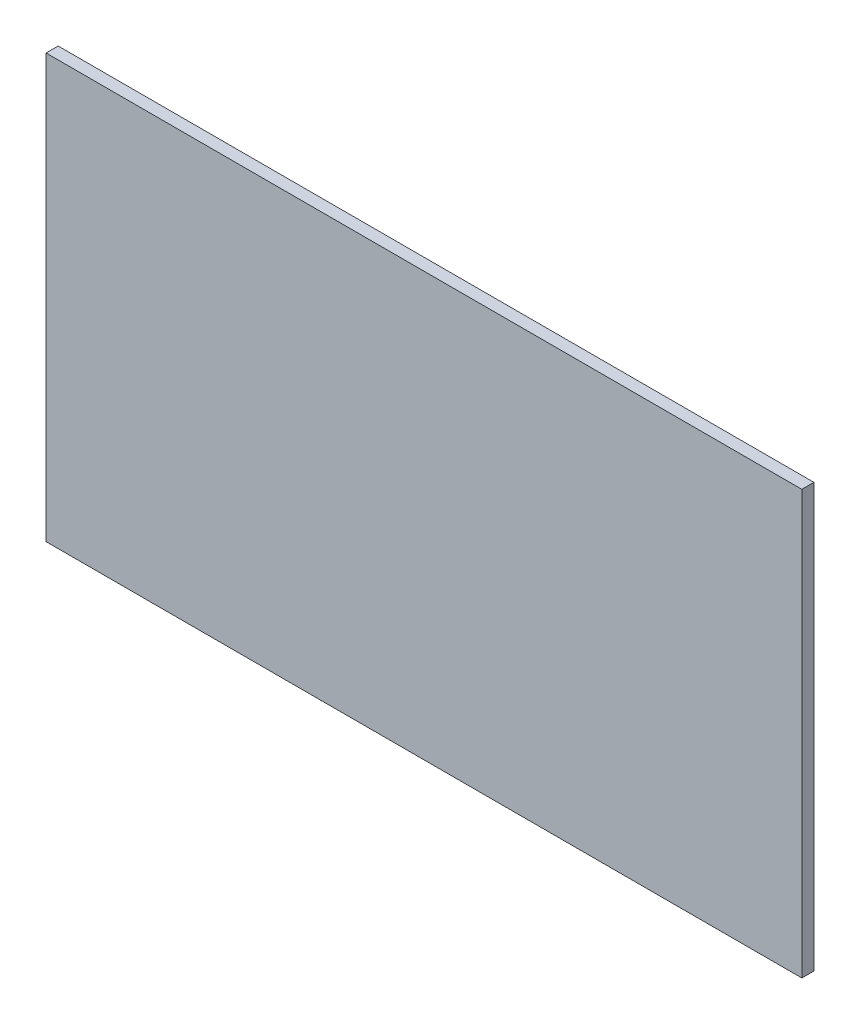
ISO-10303-21;
HEADER;
FILE_DESCRIPTION(('STEP AP214'),'2;1');
FILE_NAME('part.step','',(''),(''),'','','');
FILE_SCHEMA(('AUTOMOTIVE_DESIGN { 1 0 10303 214 1 1 1 1 }'));
ENDSEC;
DATA;
#1=APPLICATION_CONTEXT('core data for automotive mechanical design processes');
#2=APPLICATION_PROTOCOL_DEFINITION('international standard','automotive_design',2000,#1);
#3=PRODUCT_CONTEXT('',#1,'mechanical');
#4=PRODUCT('Part','Part','',(#3));
#5=PRODUCT_RELATED_PRODUCT_CATEGORY('part','',(#4));
#6=PRODUCT_DEFINITION_FORMATION('','',#4);
#7=PRODUCT_DEFINITION_CONTEXT('part definition',#1,'design');
#8=PRODUCT_DEFINITION('design','',#6,#7);
#9=PRODUCT_DEFINITION_SHAPE('','',#8);
#10=(LENGTH_UNIT() NAMED_UNIT(*) SI_UNIT(.MILLI.,.METRE.));
#11=(NAMED_UNIT(*) PLANE_ANGLE_UNIT() SI_UNIT($,.RADIAN.));
#12=(NAMED_UNIT(*) SI_UNIT($,.STERADIAN.) SOLID_ANGLE_UNIT());
#13=UNCERTAINTY_MEASURE_WITH_UNIT(LENGTH_MEASURE(1.E-05),#10,'distance_accuracy_value','');
#14=(GEOMETRIC_REPRESENTATION_CONTEXT(3) GLOBAL_UNCERTAINTY_ASSIGNED_CONTEXT((#13)) GLOBAL_UNIT_ASSIGNED_CONTEXT((#10,
#11,#12)) REPRESENTATION_CONTEXT('',''));
#15=CARTESIAN_POINT('',(0.,0.,0.));
#16=DIRECTION('',(0.,0.,1.));
#17=DIRECTION('',(1.,0.,0.));
#18=AXIS2_PLACEMENT_3D('',#15,#16,#17);
#19=CARTESIAN_POINT('',(-62.2297012284309,44.250407601747,4.));
#20=DIRECTION('',(1.,0.,0.));
#21=DIRECTION('',(0.,1.,0.));
#22=AXIS2_PLACEMENT_3D('',#19,#20,#21);
#23=PLANE('',#22);
#24=DIRECTION('',(0.,-1.,0.));
#25=VECTOR('',#24,1.);
#26=CARTESIAN_POINT('',(-62.2297012284309,44.250407601747,0.));
#27=LINE('',#26,#25);
#28=CARTESIAN_POINT('',(-62.2297012284309,44.250407601747,0.));
#29=VERTEX_POINT('',#28);
#30=CARTESIAN_POINT('',(-62.2297012284308,-95.749592398253,0.));
#31=VERTEX_POINT('',#30);
#32=EDGE_CURVE('E111',#29,#31,#27,.T.);
#33=ORIENTED_EDGE('',*,*,#32,.T.);
#34=DIRECTION('',(0.,0.,-1.));
#35=VECTOR('',#34,1.);
#36=CARTESIAN_POINT('',(-62.2297012284308,-95.749592398253,4.));
#37=LINE('',#36,#35);
#38=CARTESIAN_POINT('',(-62.2297012284308,-95.749592398253,4.));
#39=VERTEX_POINT('',#38);
#40=EDGE_CURVE('E11',#39,#31,#37,.T.);
#41=ORIENTED_EDGE('',*,*,#40,.F.);
#42=DIRECTION('',(0.,-1.,0.));
#43=VECTOR('',#42,1.);
#44=CARTESIAN_POINT('',(-62.2297012284309,44.250407601747,4.));
#45=LINE('',#44,#43);
#46=CARTESIAN_POINT('',(-62.2297012284309,44.250407601747,4.));
#47=VERTEX_POINT('',#46);
#48=EDGE_CURVE('E95',#47,#39,#45,.T.);
#49=ORIENTED_EDGE('',*,*,#48,.F.);
#50=DIRECTION('',(0.,0.,-1.));
#51=VECTOR('',#50,1.);
#52=CARTESIAN_POINT('',(-62.2297012284309,44.250407601747,4.));
#53=LINE('',#52,#51);
#54=EDGE_CURVE('E107',#47,#29,#53,.T.);
#55=ORIENTED_EDGE('',*,*,#54,.T.);
#56=EDGE_LOOP('',(#33,#41,#49,#55));
#57=FACE_BOUND('',#56,.T.);
#58=ADVANCED_FACE('F43',(#57),#23,.F.);
#59=CARTESIAN_POINT('',(-62.2297012284308,-95.749592398253,4.));
#60=DIRECTION('',(0.,1.,0.));
#61=DIRECTION('',(0.,0.,1.));
#62=AXIS2_PLACEMENT_3D('',#59,#60,#61);
#63=PLANE('',#62);
#64=DIRECTION('',(1.,0.,0.));
#65=VECTOR('',#64,1.);
#66=CARTESIAN_POINT('',(-62.2297012284308,-95.749592398253,0.));
#67=LINE('',#66,#65);
#68=CARTESIAN_POINT('',(187.770298771569,-95.749592398253,0.));
#69=VERTEX_POINT('',#68);
#70=EDGE_CURVE('E100',#31,#69,#67,.T.);
#71=ORIENTED_EDGE('',*,*,#70,.T.);
#72=DIRECTION('',(0.,0.,-1.));
#73=VECTOR('',#72,1.);
#74=CARTESIAN_POINT('',(187.770298771569,-95.749592398253,4.));
#75=LINE('',#74,#73);
#76=CARTESIAN_POINT('',(187.770298771569,-95.749592398253,4.));
#77=VERTEX_POINT('',#76);
#78=EDGE_CURVE('E52',#77,#69,#75,.T.);
#79=ORIENTED_EDGE('',*,*,#78,.F.);
#80=DIRECTION('',(1.,0.,0.));
#81=VECTOR('',#80,1.);
#82=CARTESIAN_POINT('',(-62.2297012284308,-95.749592398253,4.));
#83=LINE('',#82,#81);
#84=EDGE_CURVE('E90',#39,#77,#83,.T.);
#85=ORIENTED_EDGE('',*,*,#84,.F.);
#86=ORIENTED_EDGE('',*,*,#40,.T.);
#87=EDGE_LOOP('',(#71,#79,#85,#86));
#88=FACE_BOUND('',#87,.T.);
#89=ADVANCED_FACE('F99',(#88),#63,.F.);
#90=CARTESIAN_POINT('',(187.770298771569,44.250407601747,4.));
#91=DIRECTION('',(-1.,0.,0.));
#92=DIRECTION('',(0.,0.,1.));
#93=AXIS2_PLACEMENT_3D('',#90,#91,#92);
#94=PLANE('',#93);
#95=DIRECTION('',(0.,1.,0.));
#96=VECTOR('',#95,1.);
#97=CARTESIAN_POINT('',(187.770298771569,44.250407601747,0.));
#98=LINE('',#97,#96);
#99=CARTESIAN_POINT('',(187.770298771569,44.250407601747,0.));
#100=VERTEX_POINT('',#99);
#101=EDGE_CURVE('E77',#69,#100,#98,.T.);
#102=ORIENTED_EDGE('',*,*,#101,.T.);
#103=DIRECTION('',(0.,0.,-1.));
#104=VECTOR('',#103,1.);
#105=CARTESIAN_POINT('',(187.770298771569,44.250407601747,4.));
#106=LINE('',#105,#104);
#107=CARTESIAN_POINT('',(187.770298771569,44.250407601747,4.));
#108=VERTEX_POINT('',#107);
#109=EDGE_CURVE('E102',#108,#100,#106,.T.);
#110=ORIENTED_EDGE('',*,*,#109,.F.);
#111=DIRECTION('',(0.,1.,0.));
#112=VECTOR('',#111,1.);
#113=CARTESIAN_POINT('',(187.770298771569,44.250407601747,4.));
#114=LINE('',#113,#112);
#115=EDGE_CURVE('E93',#77,#108,#114,.T.);
#116=ORIENTED_EDGE('',*,*,#115,.F.);
#117=ORIENTED_EDGE('',*,*,#78,.T.);
#118=EDGE_LOOP('',(#102,#110,#116,#117));
#119=FACE_BOUND('',#118,.T.);
#120=ADVANCED_FACE('F103',(#119),#94,.F.);
#121=CARTESIAN_POINT('',(-62.2297012284309,44.250407601747,4.));
#122=DIRECTION('',(0.,-1.,0.));
#123=DIRECTION('',(0.,0.,-1.));
#124=AXIS2_PLACEMENT_3D('',#121,#122,#123);
#125=PLANE('',#124);
#126=DIRECTION('',(-1.,0.,0.));
#127=VECTOR('',#126,1.);
#128=CARTESIAN_POINT('',(-62.2297012284309,44.250407601747,0.));
#129=LINE('',#128,#127);
#130=EDGE_CURVE('E83',#100,#29,#129,.T.);
#131=ORIENTED_EDGE('',*,*,#130,.T.);
#132=ORIENTED_EDGE('',*,*,#54,.F.);
#133=DIRECTION('',(-1.,0.,0.));
#134=VECTOR('',#133,1.);
#135=CARTESIAN_POINT('',(-62.2297012284309,44.250407601747,4.));
#136=LINE('',#135,#134);
#137=EDGE_CURVE('E60',#108,#47,#136,.T.);
#138=ORIENTED_EDGE('',*,*,#137,.F.);
#139=ORIENTED_EDGE('',*,*,#109,.T.);
#140=EDGE_LOOP('',(#131,#132,#138,#139));
#141=FACE_BOUND('',#140,.T.);
#142=ADVANCED_FACE('F124',(#141),#125,.F.);
#143=CARTESIAN_POINT('',(0.,0.,4.));
#144=DIRECTION('',(0.,0.,1.));
#145=DIRECTION('',(1.,0.,0.));
#146=AXIS2_PLACEMENT_3D('',#143,#144,#145);
#147=PLANE('',#146);
#148=ORIENTED_EDGE('',*,*,#48,.T.);
#149=ORIENTED_EDGE('',*,*,#84,.T.);
#150=ORIENTED_EDGE('',*,*,#115,.T.);
#151=ORIENTED_EDGE('',*,*,#137,.T.);
#152=EDGE_LOOP('',(#148,#149,#150,#151));
#153=FACE_BOUND('',#152,.T.);
#154=ADVANCED_FACE('F91',(#153),#147,.T.);
#155=CARTESIAN_POINT('',(0.,0.,0.));
#156=DIRECTION('',(0.,0.,1.));
#157=DIRECTION('',(1.,0.,0.));
#158=AXIS2_PLACEMENT_3D('',#155,#156,#157);
#159=PLANE('',#158);
#160=ORIENTED_EDGE('',*,*,#32,.F.);
#161=ORIENTED_EDGE('',*,*,#130,.F.);
#162=ORIENTED_EDGE('',*,*,#101,.F.);
#163=ORIENTED_EDGE('',*,*,#70,.F.);
#164=EDGE_LOOP('',(#160,#161,#162,#163));
#165=FACE_BOUND('',#164,.T.);
#166=ADVANCED_FACE('F127',(#165),#159,.F.);
#167=CLOSED_SHELL('',(#58,#89,#120,#142,#154,#166));
#168=MANIFOLD_SOLID_BREP('B2',#167);
#169=ADVANCED_BREP_SHAPE_REPRESENTATION('',(#18,#168),#14);
#170=SHAPE_DEFINITION_REPRESENTATION(#9,#169);
ENDSEC;
END-ISO-10303-21;
